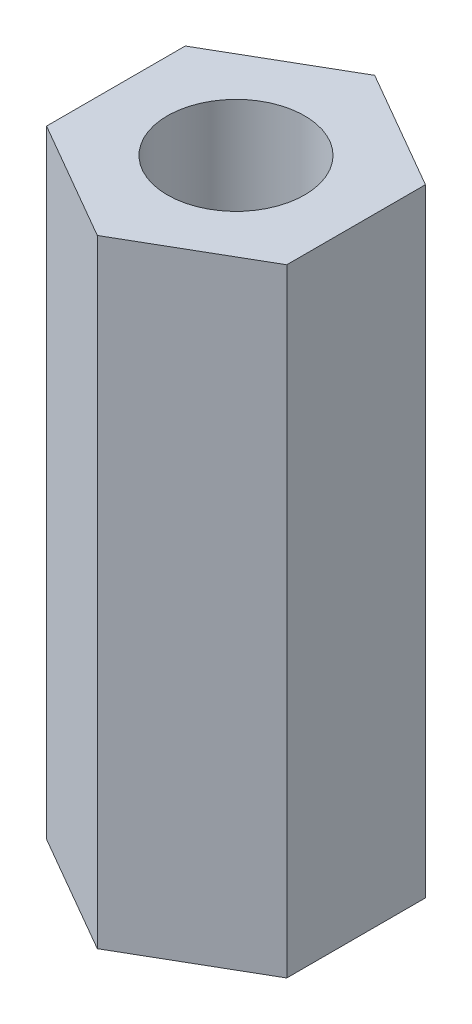
ISO-10303-21;
HEADER;
FILE_DESCRIPTION(('STEP AP214'),'2;1');
FILE_NAME('part.step','',(''),(''),'','','');
FILE_SCHEMA(('AUTOMOTIVE_DESIGN { 1 0 10303 214 1 1 1 1 }'));
ENDSEC;
DATA;
#1=APPLICATION_CONTEXT('core data for automotive mechanical design processes');
#2=APPLICATION_PROTOCOL_DEFINITION('international standard','automotive_design',2000,#1);
#3=PRODUCT_CONTEXT('',#1,'mechanical');
#4=PRODUCT('Part','Part','',(#3));
#5=PRODUCT_RELATED_PRODUCT_CATEGORY('part','',(#4));
#6=PRODUCT_DEFINITION_FORMATION('','',#4);
#7=PRODUCT_DEFINITION_CONTEXT('part definition',#1,'design');
#8=PRODUCT_DEFINITION('design','',#6,#7);
#9=PRODUCT_DEFINITION_SHAPE('','',#8);
#10=(LENGTH_UNIT() NAMED_UNIT(*) SI_UNIT(.MILLI.,.METRE.));
#11=(NAMED_UNIT(*) PLANE_ANGLE_UNIT() SI_UNIT($,.RADIAN.));
#12=(NAMED_UNIT(*) SI_UNIT($,.STERADIAN.) SOLID_ANGLE_UNIT());
#13=UNCERTAINTY_MEASURE_WITH_UNIT(LENGTH_MEASURE(1.E-05),#10,'distance_accuracy_value','');
#14=(GEOMETRIC_REPRESENTATION_CONTEXT(3) GLOBAL_UNCERTAINTY_ASSIGNED_CONTEXT((#13)) GLOBAL_UNIT_ASSIGNED_CONTEXT((#10,
#11,#12)) REPRESENTATION_CONTEXT('',''));
#15=CARTESIAN_POINT('',(0.,0.,0.));
#16=DIRECTION('',(0.,0.,1.));
#17=DIRECTION('',(1.,0.,0.));
#18=AXIS2_PLACEMENT_3D('',#15,#16,#17);
#19=CARTESIAN_POINT('',(0.,18.,0.));
#20=DIRECTION('',(0.,1.,0.));
#21=DIRECTION('',(0.,0.,1.));
#22=AXIS2_PLACEMENT_3D('',#19,#20,#21);
#23=PLANE('',#22);
#24=DIRECTION('',(-0.866025403784439,0.,-0.499999999999999));
#25=VECTOR('',#24,1.);
#26=CARTESIAN_POINT('',(-31.4518092061727,18.,-16.2277563029462));
#27=LINE('',#26,#25);
#28=CARTESIAN_POINT('',(-31.4518092061727,18.,-16.2277563029462));
#29=VERTEX_POINT('',#28);
#30=CARTESIAN_POINT('',(-34.9518092061727,18.,-18.2484822451098));
#31=VERTEX_POINT('',#30);
#32=EDGE_CURVE('E129',#29,#31,#27,.T.);
#33=ORIENTED_EDGE('',*,*,#32,.T.);
#34=DIRECTION('',(-0.866025403784438,0.,0.500000000000001));
#35=VECTOR('',#34,1.);
#36=CARTESIAN_POINT('',(-34.9518092061727,18.,-18.2484822451098));
#37=LINE('',#36,#35);
#38=CARTESIAN_POINT('',(-38.4518092061727,18.,-16.2277563029462));
#39=VERTEX_POINT('',#38);
#40=EDGE_CURVE('E87',#31,#39,#37,.T.);
#41=ORIENTED_EDGE('',*,*,#40,.T.);
#42=DIRECTION('',(0.,0.,1.));
#43=VECTOR('',#42,1.);
#44=CARTESIAN_POINT('',(-38.4518092061727,18.,-16.2277563029462));
#45=LINE('',#44,#43);
#46=CARTESIAN_POINT('',(-38.4518092061727,18.,-12.1863044186188));
#47=VERTEX_POINT('',#46);
#48=EDGE_CURVE('E100',#39,#47,#45,.T.);
#49=ORIENTED_EDGE('',*,*,#48,.T.);
#50=DIRECTION('',(0.866025403784439,0.,0.5));
#51=VECTOR('',#50,1.);
#52=CARTESIAN_POINT('',(-38.4518092061727,18.,-12.1863044186188));
#53=LINE('',#52,#51);
#54=CARTESIAN_POINT('',(-34.9518092061727,18.,-10.1655784764551));
#55=VERTEX_POINT('',#54);
#56=EDGE_CURVE('E94',#47,#55,#53,.T.);
#57=ORIENTED_EDGE('',*,*,#56,.T.);
#58=DIRECTION('',(0.866025403784438,0.,-0.5));
#59=VECTOR('',#58,1.);
#60=CARTESIAN_POINT('',(-34.9518092061727,18.,-10.1655784764551));
#61=LINE('',#60,#59);
#62=CARTESIAN_POINT('',(-31.4518092061727,18.,-12.1863044186188));
#63=VERTEX_POINT('',#62);
#64=EDGE_CURVE('E98',#55,#63,#61,.T.);
#65=ORIENTED_EDGE('',*,*,#64,.T.);
#66=DIRECTION('',(0.,0.,-1.));
#67=VECTOR('',#66,1.);
#68=CARTESIAN_POINT('',(-31.4518092061727,18.,-12.1863044186188));
#69=LINE('',#68,#67);
#70=EDGE_CURVE('E50',#63,#29,#69,.T.);
#71=ORIENTED_EDGE('',*,*,#70,.T.);
#72=EDGE_LOOP('',(#33,#41,#49,#57,#65,#71));
#73=FACE_BOUND('',#72,.T.);
#74=CARTESIAN_POINT('',(-34.9518092061727,18.,-14.2070303607825));
#75=DIRECTION('',(0.,1.,0.));
#76=DIRECTION('',(0.,0.,1.));
#77=AXIS2_PLACEMENT_3D('',#74,#75,#76);
#78=CIRCLE('',#77,2.);
#79=CARTESIAN_POINT('',(-34.9518092061727,18.,-12.2070303607825));
#80=VERTEX_POINT('',#79);
#81=EDGE_CURVE('E122',#80,#80,#78,.T.);
#82=ORIENTED_EDGE('',*,*,#81,.F.);
#83=EDGE_LOOP('',(#82));
#84=FACE_BOUND('',#83,.T.);
#85=ADVANCED_FACE('F33',(#73,#84),#23,.T.);
#86=CARTESIAN_POINT('',(0.,0.,0.));
#87=DIRECTION('',(0.,1.,0.));
#88=DIRECTION('',(0.,0.,1.));
#89=AXIS2_PLACEMENT_3D('',#86,#87,#88);
#90=PLANE('',#89);
#91=DIRECTION('',(-0.866025403784439,0.,-0.499999999999999));
#92=VECTOR('',#91,1.);
#93=CARTESIAN_POINT('',(-31.4518092061727,0.,-16.2277563029462));
#94=LINE('',#93,#92);
#95=CARTESIAN_POINT('',(-31.4518092061727,0.,-16.2277563029462));
#96=VERTEX_POINT('',#95);
#97=CARTESIAN_POINT('',(-34.9518092061727,0.,-18.2484822451098));
#98=VERTEX_POINT('',#97);
#99=EDGE_CURVE('E118',#96,#98,#94,.T.);
#100=ORIENTED_EDGE('',*,*,#99,.F.);
#101=DIRECTION('',(0.,0.,-1.));
#102=VECTOR('',#101,1.);
#103=CARTESIAN_POINT('',(-31.4518092061727,0.,-12.1863044186188));
#104=LINE('',#103,#102);
#105=CARTESIAN_POINT('',(-31.4518092061727,0.,-12.1863044186188));
#106=VERTEX_POINT('',#105);
#107=EDGE_CURVE('E79',#106,#96,#104,.T.);
#108=ORIENTED_EDGE('',*,*,#107,.F.);
#109=DIRECTION('',(0.866025403784438,0.,-0.5));
#110=VECTOR('',#109,1.);
#111=CARTESIAN_POINT('',(-34.9518092061727,0.,-10.1655784764551));
#112=LINE('',#111,#110);
#113=CARTESIAN_POINT('',(-34.9518092061727,0.,-10.1655784764551));
#114=VERTEX_POINT('',#113);
#115=EDGE_CURVE('E73',#114,#106,#112,.T.);
#116=ORIENTED_EDGE('',*,*,#115,.F.);
#117=DIRECTION('',(0.866025403784439,0.,0.5));
#118=VECTOR('',#117,1.);
#119=CARTESIAN_POINT('',(-38.4518092061727,0.,-12.1863044186188));
#120=LINE('',#119,#118);
#121=CARTESIAN_POINT('',(-38.4518092061727,0.,-12.1863044186188));
#122=VERTEX_POINT('',#121);
#123=EDGE_CURVE('E108',#122,#114,#120,.T.);
#124=ORIENTED_EDGE('',*,*,#123,.F.);
#125=DIRECTION('',(0.,0.,1.));
#126=VECTOR('',#125,1.);
#127=CARTESIAN_POINT('',(-38.4518092061727,0.,-16.2277563029462));
#128=LINE('',#127,#126);
#129=CARTESIAN_POINT('',(-38.4518092061727,0.,-16.2277563029462));
#130=VERTEX_POINT('',#129);
#131=EDGE_CURVE('E124',#130,#122,#128,.T.);
#132=ORIENTED_EDGE('',*,*,#131,.F.);
#133=DIRECTION('',(-0.866025403784438,0.,0.500000000000001));
#134=VECTOR('',#133,1.);
#135=CARTESIAN_POINT('',(-34.9518092061727,0.,-18.2484822451098));
#136=LINE('',#135,#134);
#137=EDGE_CURVE('E121',#98,#130,#136,.T.);
#138=ORIENTED_EDGE('',*,*,#137,.F.);
#139=EDGE_LOOP('',(#100,#108,#116,#124,#132,#138));
#140=FACE_BOUND('',#139,.T.);
#141=CARTESIAN_POINT('',(-34.9518092061727,0.,-14.2070303607825));
#142=DIRECTION('',(0.,1.,0.));
#143=DIRECTION('',(0.,0.,1.));
#144=AXIS2_PLACEMENT_3D('',#141,#142,#143);
#145=CIRCLE('',#144,2.);
#146=CARTESIAN_POINT('',(-34.9518092061727,0.,-12.2070303607825));
#147=VERTEX_POINT('',#146);
#148=EDGE_CURVE('E222',#147,#147,#145,.T.);
#149=ORIENTED_EDGE('',*,*,#148,.T.);
#150=EDGE_LOOP('',(#149));
#151=FACE_BOUND('',#150,.T.);
#152=ADVANCED_FACE('F138',(#140,#151),#90,.F.);
#153=CARTESIAN_POINT('',(-31.4518092061727,18.,-16.2277563029462));
#154=DIRECTION('',(-0.499999999999999,0.,0.866025403784439));
#155=DIRECTION('',(0.866025403784439,0.,0.499999999999999));
#156=AXIS2_PLACEMENT_3D('',#153,#154,#155);
#157=PLANE('',#156);
#158=ORIENTED_EDGE('',*,*,#99,.T.);
#159=DIRECTION('',(0.,-1.,0.));
#160=VECTOR('',#159,1.);
#161=CARTESIAN_POINT('',(-34.9518092061727,18.,-18.2484822451098));
#162=LINE('',#161,#160);
#163=EDGE_CURVE('E11',#31,#98,#162,.T.);
#164=ORIENTED_EDGE('',*,*,#163,.F.);
#165=ORIENTED_EDGE('',*,*,#32,.F.);
#166=DIRECTION('',(0.,-1.,0.));
#167=VECTOR('',#166,1.);
#168=CARTESIAN_POINT('',(-31.4518092061727,18.,-16.2277563029462));
#169=LINE('',#168,#167);
#170=EDGE_CURVE('E114',#29,#96,#169,.T.);
#171=ORIENTED_EDGE('',*,*,#170,.T.);
#172=EDGE_LOOP('',(#158,#164,#165,#171));
#173=FACE_BOUND('',#172,.T.);
#174=ADVANCED_FACE('F35',(#173),#157,.F.);
#175=CARTESIAN_POINT('',(-34.9518092061727,18.,-18.2484822451098));
#176=DIRECTION('',(0.500000000000001,0.,0.866025403784438));
#177=DIRECTION('',(0.866025403784438,0.,-0.500000000000001));
#178=AXIS2_PLACEMENT_3D('',#175,#176,#177);
#179=PLANE('',#178);
#180=ORIENTED_EDGE('',*,*,#137,.T.);
#181=DIRECTION('',(0.,-1.,0.));
#182=VECTOR('',#181,1.);
#183=CARTESIAN_POINT('',(-38.4518092061727,18.,-16.2277563029462));
#184=LINE('',#183,#182);
#185=EDGE_CURVE('E42',#39,#130,#184,.T.);
#186=ORIENTED_EDGE('',*,*,#185,.F.);
#187=ORIENTED_EDGE('',*,*,#40,.F.);
#188=ORIENTED_EDGE('',*,*,#163,.T.);
#189=EDGE_LOOP('',(#180,#186,#187,#188));
#190=FACE_BOUND('',#189,.T.);
#191=ADVANCED_FACE('F163',(#190),#179,.F.);
#192=CARTESIAN_POINT('',(-38.4518092061727,18.,-16.2277563029462));
#193=DIRECTION('',(1.,0.,0.));
#194=DIRECTION('',(0.,0.,-1.));
#195=AXIS2_PLACEMENT_3D('',#192,#193,#194);
#196=PLANE('',#195);
#197=ORIENTED_EDGE('',*,*,#131,.T.);
#198=DIRECTION('',(0.,-1.,0.));
#199=VECTOR('',#198,1.);
#200=CARTESIAN_POINT('',(-38.4518092061727,18.,-12.1863044186188));
#201=LINE('',#200,#199);
#202=EDGE_CURVE('E109',#47,#122,#201,.T.);
#203=ORIENTED_EDGE('',*,*,#202,.F.);
#204=ORIENTED_EDGE('',*,*,#48,.F.);
#205=ORIENTED_EDGE('',*,*,#185,.T.);
#206=EDGE_LOOP('',(#197,#203,#204,#205));
#207=FACE_BOUND('',#206,.T.);
#208=ADVANCED_FACE('F135',(#207),#196,.F.);
#209=CARTESIAN_POINT('',(-38.4518092061727,18.,-12.1863044186188));
#210=DIRECTION('',(0.5,0.,-0.866025403784439));
#211=DIRECTION('',(-0.866025403784439,0.,-0.5));
#212=AXIS2_PLACEMENT_3D('',#209,#210,#211);
#213=PLANE('',#212);
#214=ORIENTED_EDGE('',*,*,#123,.T.);
#215=DIRECTION('',(0.,-1.,0.));
#216=VECTOR('',#215,1.);
#217=CARTESIAN_POINT('',(-34.9518092061727,18.,-10.1655784764551));
#218=LINE('',#217,#216);
#219=EDGE_CURVE('E105',#55,#114,#218,.T.);
#220=ORIENTED_EDGE('',*,*,#219,.F.);
#221=ORIENTED_EDGE('',*,*,#56,.F.);
#222=ORIENTED_EDGE('',*,*,#202,.T.);
#223=EDGE_LOOP('',(#214,#220,#221,#222));
#224=FACE_BOUND('',#223,.T.);
#225=ADVANCED_FACE('F106',(#224),#213,.F.);
#226=CARTESIAN_POINT('',(-34.9518092061727,18.,-10.1655784764551));
#227=DIRECTION('',(-0.5,0.,-0.866025403784438));
#228=DIRECTION('',(-0.866025403784439,0.,0.5));
#229=AXIS2_PLACEMENT_3D('',#226,#227,#228);
#230=PLANE('',#229);
#231=ORIENTED_EDGE('',*,*,#115,.T.);
#232=DIRECTION('',(0.,-1.,0.));
#233=VECTOR('',#232,1.);
#234=CARTESIAN_POINT('',(-31.4518092061727,18.,-12.1863044186188));
#235=LINE('',#234,#233);
#236=EDGE_CURVE('E110',#63,#106,#235,.T.);
#237=ORIENTED_EDGE('',*,*,#236,.F.);
#238=ORIENTED_EDGE('',*,*,#64,.F.);
#239=ORIENTED_EDGE('',*,*,#219,.T.);
#240=EDGE_LOOP('',(#231,#237,#238,#239));
#241=FACE_BOUND('',#240,.T.);
#242=ADVANCED_FACE('F112',(#241),#230,.F.);
#243=CARTESIAN_POINT('',(-31.4518092061727,18.,-12.1863044186188));
#244=DIRECTION('',(-1.,0.,0.));
#245=DIRECTION('',(0.,0.,1.));
#246=AXIS2_PLACEMENT_3D('',#243,#244,#245);
#247=PLANE('',#246);
#248=ORIENTED_EDGE('',*,*,#107,.T.);
#249=ORIENTED_EDGE('',*,*,#170,.F.);
#250=ORIENTED_EDGE('',*,*,#70,.F.);
#251=ORIENTED_EDGE('',*,*,#236,.T.);
#252=EDGE_LOOP('',(#248,#249,#250,#251));
#253=FACE_BOUND('',#252,.T.);
#254=ADVANCED_FACE('F143',(#253),#247,.F.);
#255=CARTESIAN_POINT('',(-34.9518092061727,18.,-14.2070303607825));
#256=DIRECTION('',(0.,-1.,0.));
#257=DIRECTION('',(0.,0.,-1.));
#258=AXIS2_PLACEMENT_3D('',#255,#256,#257);
#259=CYLINDRICAL_SURFACE('',#258,2.);
#260=ORIENTED_EDGE('',*,*,#81,.T.);
#261=EDGE_LOOP('',(#260));
#262=FACE_BOUND('',#261,.T.);
#263=ORIENTED_EDGE('',*,*,#148,.F.);
#264=EDGE_LOOP('',(#263));
#265=FACE_BOUND('',#264,.T.);
#266=ADVANCED_FACE('F145',(#262,#265),#259,.F.);
#267=CLOSED_SHELL('',(#85,#152,#174,#191,#208,#225,#242,#254,#266));
#268=MANIFOLD_SOLID_BREP('B2',#267);
#269=ADVANCED_BREP_SHAPE_REPRESENTATION('',(#18,#268),#14);
#270=SHAPE_DEFINITION_REPRESENTATION(#9,#269);
ENDSEC;
END-ISO-10303-21;
